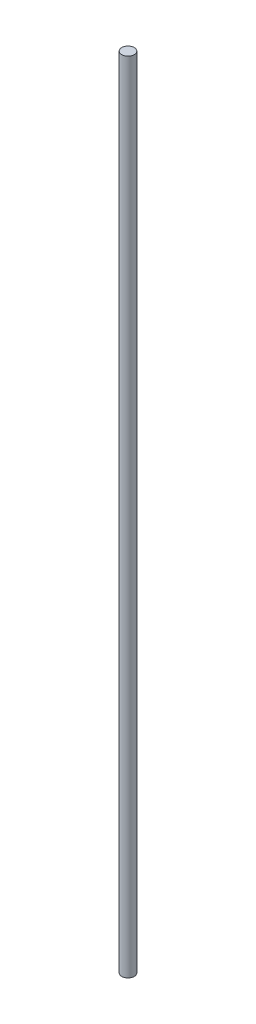
ISO-10303-21;
HEADER;
FILE_DESCRIPTION(('STEP AP214'),'2;1');
FILE_NAME('part.step','',(''),(''),'','','');
FILE_SCHEMA(('AUTOMOTIVE_DESIGN { 1 0 10303 214 1 1 1 1 }'));
ENDSEC;
DATA;
#1=APPLICATION_CONTEXT('core data for automotive mechanical design processes');
#2=APPLICATION_PROTOCOL_DEFINITION('international standard','automotive_design',2000,#1);
#3=PRODUCT_CONTEXT('',#1,'mechanical');
#4=PRODUCT('Part','Part','',(#3));
#5=PRODUCT_RELATED_PRODUCT_CATEGORY('part','',(#4));
#6=PRODUCT_DEFINITION_FORMATION('','',#4);
#7=PRODUCT_DEFINITION_CONTEXT('part definition',#1,'design');
#8=PRODUCT_DEFINITION('design','',#6,#7);
#9=PRODUCT_DEFINITION_SHAPE('','',#8);
#10=(LENGTH_UNIT() NAMED_UNIT(*) SI_UNIT(.MILLI.,.METRE.));
#11=(NAMED_UNIT(*) PLANE_ANGLE_UNIT() SI_UNIT($,.RADIAN.));
#12=(NAMED_UNIT(*) SI_UNIT($,.STERADIAN.) SOLID_ANGLE_UNIT());
#13=UNCERTAINTY_MEASURE_WITH_UNIT(LENGTH_MEASURE(1.E-05),#10,'distance_accuracy_value','');
#14=(GEOMETRIC_REPRESENTATION_CONTEXT(3) GLOBAL_UNCERTAINTY_ASSIGNED_CONTEXT((#13)) GLOBAL_UNIT_ASSIGNED_CONTEXT((#10,
#11,#12)) REPRESENTATION_CONTEXT('',''));
#15=CARTESIAN_POINT('',(0.,0.,0.));
#16=DIRECTION('',(0.,0.,1.));
#17=DIRECTION('',(1.,0.,0.));
#18=AXIS2_PLACEMENT_3D('',#15,#16,#17);
#19=CARTESIAN_POINT('',(0.,609.6,0.));
#20=DIRECTION('',(0.,-1.,0.));
#21=DIRECTION('',(0.,0.,-1.));
#22=AXIS2_PLACEMENT_3D('',#19,#20,#21);
#23=CYLINDRICAL_SURFACE('',#22,4.7625);
#24=CARTESIAN_POINT('',(0.,609.6,0.));
#25=DIRECTION('',(0.,1.,0.));
#26=DIRECTION('',(0.,0.,1.));
#27=AXIS2_PLACEMENT_3D('',#24,#25,#26);
#28=CIRCLE('',#27,4.7625);
#29=CARTESIAN_POINT('',(0.,609.6,4.7625));
#30=VERTEX_POINT('',#29);
#31=EDGE_CURVE('E10',#30,#30,#28,.T.);
#32=ORIENTED_EDGE('',*,*,#31,.F.);
#33=EDGE_LOOP('',(#32));
#34=FACE_BOUND('',#33,.T.);
#35=CARTESIAN_POINT('',(0.,0.,0.));
#36=DIRECTION('',(0.,1.,0.));
#37=DIRECTION('',(0.,0.,1.));
#38=AXIS2_PLACEMENT_3D('',#35,#36,#37);
#39=CIRCLE('',#38,4.7625);
#40=CARTESIAN_POINT('',(0.,0.,4.7625));
#41=VERTEX_POINT('',#40);
#42=EDGE_CURVE('E36',#41,#41,#39,.T.);
#43=ORIENTED_EDGE('',*,*,#42,.T.);
#44=EDGE_LOOP('',(#43));
#45=FACE_BOUND('',#44,.T.);
#46=ADVANCED_FACE('F33',(#34,#45),#23,.T.);
#47=CARTESIAN_POINT('',(0.,609.6,0.));
#48=DIRECTION('',(0.,1.,0.));
#49=DIRECTION('',(0.,0.,1.));
#50=AXIS2_PLACEMENT_3D('',#47,#48,#49);
#51=PLANE('',#50);
#52=ORIENTED_EDGE('',*,*,#31,.T.);
#53=EDGE_LOOP('',(#52));
#54=FACE_BOUND('',#53,.T.);
#55=ADVANCED_FACE('F48',(#54),#51,.T.);
#56=CARTESIAN_POINT('',(0.,0.,0.));
#57=DIRECTION('',(0.,1.,0.));
#58=DIRECTION('',(0.,0.,1.));
#59=AXIS2_PLACEMENT_3D('',#56,#57,#58);
#60=PLANE('',#59);
#61=ORIENTED_EDGE('',*,*,#42,.F.);
#62=EDGE_LOOP('',(#61));
#63=FACE_BOUND('',#62,.T.);
#64=ADVANCED_FACE('F46',(#63),#60,.F.);
#65=CLOSED_SHELL('',(#46,#55,#64));
#66=MANIFOLD_SOLID_BREP('B2',#65);
#67=ADVANCED_BREP_SHAPE_REPRESENTATION('',(#18,#66),#14);
#68=SHAPE_DEFINITION_REPRESENTATION(#9,#67);
ENDSEC;
END-ISO-10303-21;
